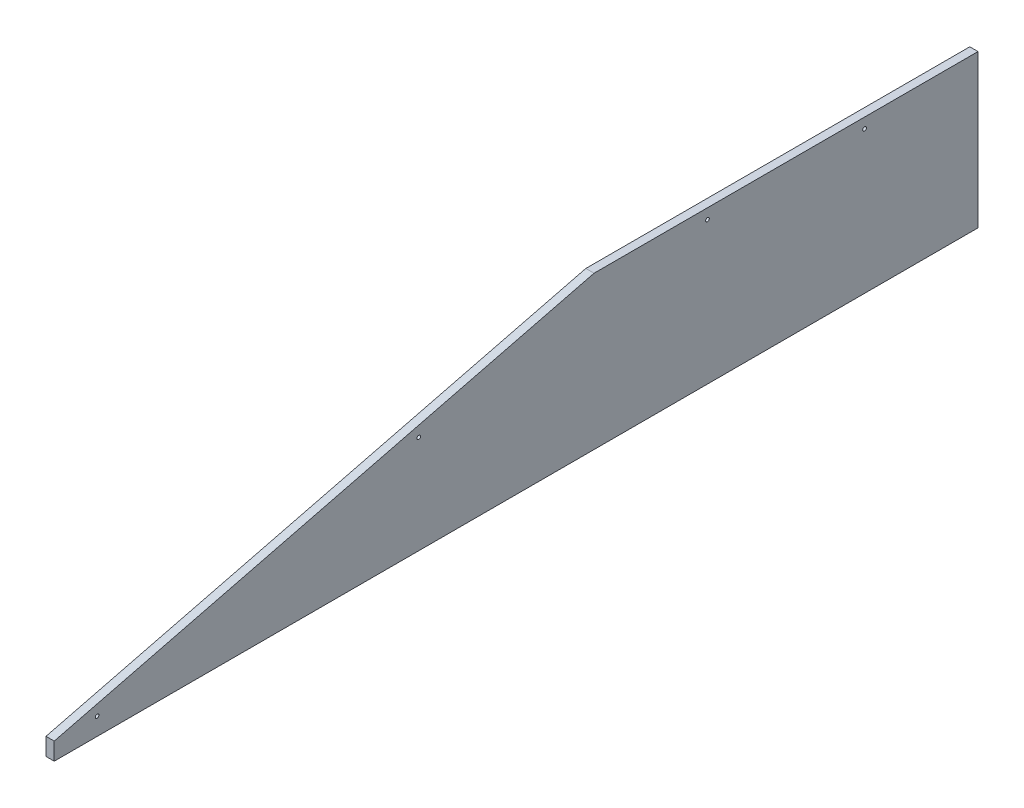
ISO-10303-21;
HEADER;
FILE_DESCRIPTION(('STEP AP214'),'2;1');
FILE_NAME('part.step','',(''),(''),'','','');
FILE_SCHEMA(('AUTOMOTIVE_DESIGN { 1 0 10303 214 1 1 1 1 }'));
ENDSEC;
DATA;
#1=APPLICATION_CONTEXT('core data for automotive mechanical design processes');
#2=APPLICATION_PROTOCOL_DEFINITION('international standard','automotive_design',2000,#1);
#3=PRODUCT_CONTEXT('',#1,'mechanical');
#4=PRODUCT('Part','Part','',(#3));
#5=PRODUCT_RELATED_PRODUCT_CATEGORY('part','',(#4));
#6=PRODUCT_DEFINITION_FORMATION('','',#4);
#7=PRODUCT_DEFINITION_CONTEXT('part definition',#1,'design');
#8=PRODUCT_DEFINITION('design','',#6,#7);
#9=PRODUCT_DEFINITION_SHAPE('','',#8);
#10=(LENGTH_UNIT() NAMED_UNIT(*) SI_UNIT(.MILLI.,.METRE.));
#11=(NAMED_UNIT(*) PLANE_ANGLE_UNIT() SI_UNIT($,.RADIAN.));
#12=(NAMED_UNIT(*) SI_UNIT($,.STERADIAN.) SOLID_ANGLE_UNIT());
#13=UNCERTAINTY_MEASURE_WITH_UNIT(LENGTH_MEASURE(1.E-05),#10,'distance_accuracy_value','');
#14=(GEOMETRIC_REPRESENTATION_CONTEXT(3) GLOBAL_UNCERTAINTY_ASSIGNED_CONTEXT((#13)) GLOBAL_UNIT_ASSIGNED_CONTEXT((#10,
#11,#12)) REPRESENTATION_CONTEXT('',''));
#15=CARTESIAN_POINT('',(0.,0.,0.));
#16=DIRECTION('',(0.,0.,1.));
#17=DIRECTION('',(1.,0.,0.));
#18=AXIS2_PLACEMENT_3D('',#15,#16,#17);
#19=CARTESIAN_POINT('',(0.,222.25,0.));
#20=DIRECTION('',(0.,1.,0.));
#21=DIRECTION('',(0.,0.,1.));
#22=AXIS2_PLACEMENT_3D('',#19,#20,#21);
#23=PLANE('',#22);
#24=DIRECTION('',(-1.,0.,0.));
#25=VECTOR('',#24,1.);
#26=CARTESIAN_POINT('',(6.,222.25,558.8));
#27=LINE('',#26,#25);
#28=CARTESIAN_POINT('',(12.,222.25,558.799999855873));
#29=VERTEX_POINT('',#28);
#30=CARTESIAN_POINT('',(0.,222.25,558.8));
#31=VERTEX_POINT('',#30);
#32=EDGE_CURVE('E81',#29,#31,#27,.T.);
#33=ORIENTED_EDGE('',*,*,#32,.F.);
#34=DIRECTION('',(0.,0.,1.));
#35=VECTOR('',#34,1.);
#36=CARTESIAN_POINT('',(12.,222.25,672.2051232825));
#37=LINE('',#36,#35);
#38=CARTESIAN_POINT('',(12.,222.25,0.));
#39=VERTEX_POINT('',#38);
#40=EDGE_CURVE('E63',#39,#29,#37,.T.);
#41=ORIENTED_EDGE('',*,*,#40,.F.);
#42=DIRECTION('',(1.,0.,0.));
#43=VECTOR('',#42,1.);
#44=CARTESIAN_POINT('',(6.,222.25,0.));
#45=LINE('',#44,#43);
#46=CARTESIAN_POINT('',(0.,222.25,0.));
#47=VERTEX_POINT('',#46);
#48=EDGE_CURVE('E123',#47,#39,#45,.T.);
#49=ORIENTED_EDGE('',*,*,#48,.F.);
#50=DIRECTION('',(0.,0.,1.));
#51=VECTOR('',#50,1.);
#52=CARTESIAN_POINT('',(0.,222.25,672.2051232825));
#53=LINE('',#52,#51);
#54=EDGE_CURVE('E91',#47,#31,#53,.T.);
#55=ORIENTED_EDGE('',*,*,#54,.T.);
#56=EDGE_LOOP('',(#33,#41,#49,#55));
#57=FACE_BOUND('',#56,.T.);
#58=ADVANCED_FACE('F16',(#57),#23,.T.);
#59=CARTESIAN_POINT('',(0.,222.25,558.8));
#60=DIRECTION('',(0.,0.970012369464204,0.243055555555601));
#61=DIRECTION('',(0.,-0.243055555555601,0.970012369464204));
#62=AXIS2_PLACEMENT_3D('',#59,#60,#61);
#63=PLANE('',#62);
#64=DIRECTION('',(1.,0.,0.));
#65=VECTOR('',#64,1.);
#66=CARTESIAN_POINT('',(6.,25.4,1344.410246565));
#67=LINE('',#66,#65);
#68=CARTESIAN_POINT('',(0.,25.4,1344.410246565));
#69=VERTEX_POINT('',#68);
#70=CARTESIAN_POINT('',(12.,25.39999996825,1344.410246565));
#71=VERTEX_POINT('',#70);
#72=EDGE_CURVE('E73',#69,#71,#67,.T.);
#73=ORIENTED_EDGE('',*,*,#72,.T.);
#74=DIRECTION('',(0.,-0.243055555545461,0.970012369466744));
#75=VECTOR('',#74,1.);
#76=CARTESIAN_POINT('',(12.,222.24999994903,558.799999915165));
#77=LINE('',#76,#75);
#78=EDGE_CURVE('E20',#29,#71,#77,.T.);
#79=ORIENTED_EDGE('',*,*,#78,.F.);
#80=ORIENTED_EDGE('',*,*,#32,.T.);
#81=DIRECTION('',(0.,-0.243055555555601,0.970012369464204));
#82=VECTOR('',#81,1.);
#83=CARTESIAN_POINT('',(0.,222.25,558.8));
#84=LINE('',#83,#82);
#85=EDGE_CURVE('E76',#31,#69,#84,.T.);
#86=ORIENTED_EDGE('',*,*,#85,.T.);
#87=EDGE_LOOP('',(#73,#79,#80,#86));
#88=FACE_BOUND('',#87,.T.);
#89=ADVANCED_FACE('F74',(#88),#63,.T.);
#90=CARTESIAN_POINT('',(12.,0.,1344.410246565));
#91=DIRECTION('',(0.,0.,-1.));
#92=DIRECTION('',(-1.,0.,0.));
#93=AXIS2_PLACEMENT_3D('',#90,#91,#92);
#94=PLANE('',#93);
#95=ORIENTED_EDGE('',*,*,#72,.F.);
#96=DIRECTION('',(0.,-1.,0.));
#97=VECTOR('',#96,1.);
#98=CARTESIAN_POINT('',(0.,111.125,1344.410246565));
#99=LINE('',#98,#97);
#100=CARTESIAN_POINT('',(0.,0.,1344.410246565));
#101=VERTEX_POINT('',#100);
#102=EDGE_CURVE('E95',#69,#101,#99,.T.);
#103=ORIENTED_EDGE('',*,*,#102,.T.);
#104=DIRECTION('',(-1.,0.,0.));
#105=VECTOR('',#104,1.);
#106=CARTESIAN_POINT('',(6.,0.,1344.410246565));
#107=LINE('',#106,#105);
#108=CARTESIAN_POINT('',(12.,0.,1344.410246565));
#109=VERTEX_POINT('',#108);
#110=EDGE_CURVE('E80',#109,#101,#107,.T.);
#111=ORIENTED_EDGE('',*,*,#110,.F.);
#112=DIRECTION('',(0.,-1.,0.));
#113=VECTOR('',#112,1.);
#114=CARTESIAN_POINT('',(12.,111.125,1344.410246565));
#115=LINE('',#114,#113);
#116=EDGE_CURVE('E69',#71,#109,#115,.T.);
#117=ORIENTED_EDGE('',*,*,#116,.F.);
#118=EDGE_LOOP('',(#95,#103,#111,#117));
#119=FACE_BOUND('',#118,.T.);
#120=ADVANCED_FACE('F83',(#119),#94,.F.);
#121=CARTESIAN_POINT('',(0.,0.,1344.410246565));
#122=DIRECTION('',(0.,-1.,0.));
#123=DIRECTION('',(0.,0.,-1.));
#124=AXIS2_PLACEMENT_3D('',#121,#122,#123);
#125=PLANE('',#124);
#126=DIRECTION('',(-1.,0.,0.));
#127=VECTOR('',#126,1.);
#128=CARTESIAN_POINT('',(6.,0.,0.));
#129=LINE('',#128,#127);
#130=CARTESIAN_POINT('',(12.,0.,0.));
#131=VERTEX_POINT('',#130);
#132=CARTESIAN_POINT('',(0.,0.,0.));
#133=VERTEX_POINT('',#132);
#134=EDGE_CURVE('E35',#131,#133,#129,.T.);
#135=ORIENTED_EDGE('',*,*,#134,.F.);
#136=DIRECTION('',(0.,0.,-1.));
#137=VECTOR('',#136,1.);
#138=CARTESIAN_POINT('',(12.,0.,672.2051232825));
#139=LINE('',#138,#137);
#140=EDGE_CURVE('E85',#109,#131,#139,.T.);
#141=ORIENTED_EDGE('',*,*,#140,.F.);
#142=ORIENTED_EDGE('',*,*,#110,.T.);
#143=DIRECTION('',(0.,0.,-1.));
#144=VECTOR('',#143,1.);
#145=CARTESIAN_POINT('',(0.,0.,672.2051232825));
#146=LINE('',#145,#144);
#147=EDGE_CURVE('E96',#101,#133,#146,.T.);
#148=ORIENTED_EDGE('',*,*,#147,.T.);
#149=EDGE_LOOP('',(#135,#141,#142,#148));
#150=FACE_BOUND('',#149,.T.);
#151=ADVANCED_FACE('F134',(#150),#125,.T.);
#152=CARTESIAN_POINT('',(0.,0.,0.));
#153=DIRECTION('',(0.,0.,-1.));
#154=DIRECTION('',(0.,1.,0.));
#155=AXIS2_PLACEMENT_3D('',#152,#153,#154);
#156=PLANE('',#155);
#157=ORIENTED_EDGE('',*,*,#48,.T.);
#158=DIRECTION('',(0.,1.,0.));
#159=VECTOR('',#158,1.);
#160=CARTESIAN_POINT('',(12.,111.125,0.));
#161=LINE('',#160,#159);
#162=EDGE_CURVE('E87',#131,#39,#161,.T.);
#163=ORIENTED_EDGE('',*,*,#162,.F.);
#164=ORIENTED_EDGE('',*,*,#134,.T.);
#165=DIRECTION('',(0.,1.,0.));
#166=VECTOR('',#165,1.);
#167=CARTESIAN_POINT('',(0.,111.125,0.));
#168=LINE('',#167,#166);
#169=EDGE_CURVE('E109',#133,#47,#168,.T.);
#170=ORIENTED_EDGE('',*,*,#169,.T.);
#171=EDGE_LOOP('',(#157,#163,#164,#170));
#172=FACE_BOUND('',#171,.T.);
#173=ADVANCED_FACE('F131',(#172),#156,.T.);
#174=CARTESIAN_POINT('',(12.,142.890477965,813.859868381));
#175=DIRECTION('',(-1.,0.,0.));
#176=DIRECTION('',(0.,0.,1.));
#177=AXIS2_PLACEMENT_3D('',#174,#175,#176);
#178=CYLINDRICAL_SURFACE('',#177,2.66699999999997);
#179=CARTESIAN_POINT('',(0.,142.890477965,813.859868381));
#180=DIRECTION('',(-1.,0.,0.));
#181=DIRECTION('',(0.,0.,1.));
#182=AXIS2_PLACEMENT_3D('',#179,#180,#181);
#183=CIRCLE('',#182,2.66699999999997);
#184=CARTESIAN_POINT('',(0.,142.890477965,816.526868381));
#185=VERTEX_POINT('',#184);
#186=EDGE_CURVE('E106',#185,#185,#183,.T.);
#187=ORIENTED_EDGE('',*,*,#186,.T.);
#188=EDGE_LOOP('',(#187));
#189=FACE_BOUND('',#188,.T.);
#190=CARTESIAN_POINT('',(12.,142.890477965,813.859868381));
#191=DIRECTION('',(-1.,0.,0.));
#192=DIRECTION('',(0.,0.,1.));
#193=AXIS2_PLACEMENT_3D('',#190,#191,#192);
#194=CIRCLE('',#193,2.66699999999997);
#195=CARTESIAN_POINT('',(12.,142.890477965,816.526868381));
#196=VERTEX_POINT('',#195);
#197=EDGE_CURVE('E115',#196,#196,#194,.T.);
#198=ORIENTED_EDGE('',*,*,#197,.F.);
#199=EDGE_LOOP('',(#198));
#200=FACE_BOUND('',#199,.T.);
#201=ADVANCED_FACE('F142',(#189,#200),#178,.F.);
#202=CARTESIAN_POINT('',(12.,207.264,393.7));
#203=DIRECTION('',(-1.,0.,0.));
#204=DIRECTION('',(0.,0.,1.));
#205=AXIS2_PLACEMENT_3D('',#202,#203,#204);
#206=CYLINDRICAL_SURFACE('',#205,2.66700000000003);
#207=CARTESIAN_POINT('',(0.,207.264,393.7));
#208=DIRECTION('',(-1.,0.,0.));
#209=DIRECTION('',(0.,0.,1.));
#210=AXIS2_PLACEMENT_3D('',#207,#208,#209);
#211=CIRCLE('',#210,2.66700000000003);
#212=CARTESIAN_POINT('',(0.,207.264,396.367));
#213=VERTEX_POINT('',#212);
#214=EDGE_CURVE('E103',#213,#213,#211,.T.);
#215=ORIENTED_EDGE('',*,*,#214,.T.);
#216=EDGE_LOOP('',(#215));
#217=FACE_BOUND('',#216,.T.);
#218=CARTESIAN_POINT('',(12.,207.264,393.7));
#219=DIRECTION('',(-1.,0.,0.));
#220=DIRECTION('',(0.,0.,1.));
#221=AXIS2_PLACEMENT_3D('',#218,#219,#220);
#222=CIRCLE('',#221,2.66700000000003);
#223=CARTESIAN_POINT('',(12.,207.264,396.367));
#224=VERTEX_POINT('',#223);
#225=EDGE_CURVE('E113',#224,#224,#222,.T.);
#226=ORIENTED_EDGE('',*,*,#225,.F.);
#227=EDGE_LOOP('',(#226));
#228=FACE_BOUND('',#227,.T.);
#229=ADVANCED_FACE('F158',(#217,#228),#206,.F.);
#230=CARTESIAN_POINT('',(12.,207.264,165.1));
#231=DIRECTION('',(-1.,0.,0.));
#232=DIRECTION('',(0.,0.,1.));
#233=AXIS2_PLACEMENT_3D('',#230,#231,#232);
#234=CYLINDRICAL_SURFACE('',#233,2.667);
#235=CARTESIAN_POINT('',(0.,207.264,165.1));
#236=DIRECTION('',(-1.,0.,0.));
#237=DIRECTION('',(0.,0.,1.));
#238=AXIS2_PLACEMENT_3D('',#235,#236,#237);
#239=CIRCLE('',#238,2.667);
#240=CARTESIAN_POINT('',(0.,207.264,167.767));
#241=VERTEX_POINT('',#240);
#242=EDGE_CURVE('E100',#241,#241,#239,.T.);
#243=ORIENTED_EDGE('',*,*,#242,.T.);
#244=EDGE_LOOP('',(#243));
#245=FACE_BOUND('',#244,.T.);
#246=CARTESIAN_POINT('',(12.,207.264,165.1));
#247=DIRECTION('',(-1.,0.,0.));
#248=DIRECTION('',(0.,0.,1.));
#249=AXIS2_PLACEMENT_3D('',#246,#247,#248);
#250=CIRCLE('',#249,2.667);
#251=CARTESIAN_POINT('',(12.,207.264,167.767));
#252=VERTEX_POINT('',#251);
#253=EDGE_CURVE('E94',#252,#252,#250,.T.);
#254=ORIENTED_EDGE('',*,*,#253,.F.);
#255=EDGE_LOOP('',(#254));
#256=FACE_BOUND('',#255,.T.);
#257=ADVANCED_FACE('F155',(#245,#256),#234,.F.);
#258=CARTESIAN_POINT('',(12.,0.,1344.410246565));
#259=DIRECTION('',(1.,0.,0.));
#260=DIRECTION('',(0.,0.,-1.));
#261=AXIS2_PLACEMENT_3D('',#258,#259,#260);
#262=PLANE('',#261);
#263=ORIENTED_EDGE('',*,*,#253,.T.);
#264=EDGE_LOOP('',(#263));
#265=FACE_BOUND('',#264,.T.);
#266=ORIENTED_EDGE('',*,*,#225,.T.);
#267=EDGE_LOOP('',(#266));
#268=FACE_BOUND('',#267,.T.);
#269=ORIENTED_EDGE('',*,*,#197,.T.);
#270=EDGE_LOOP('',(#269));
#271=FACE_BOUND('',#270,.T.);
#272=CARTESIAN_POINT('',(12.,25.591866853,1281.987837884));
#273=DIRECTION('',(-1.,0.,0.));
#274=DIRECTION('',(0.,0.,1.));
#275=AXIS2_PLACEMENT_3D('',#272,#273,#274);
#276=CIRCLE('',#275,2.66699999999975);
#277=CARTESIAN_POINT('',(12.,25.591866853,1284.654837884));
#278=VERTEX_POINT('',#277);
#279=EDGE_CURVE('E26',#278,#278,#276,.F.);
#280=ORIENTED_EDGE('',*,*,#279,.F.);
#281=EDGE_LOOP('',(#280));
#282=FACE_BOUND('',#281,.T.);
#283=ORIENTED_EDGE('',*,*,#140,.T.);
#284=ORIENTED_EDGE('',*,*,#162,.T.);
#285=ORIENTED_EDGE('',*,*,#40,.T.);
#286=ORIENTED_EDGE('',*,*,#78,.T.);
#287=ORIENTED_EDGE('',*,*,#116,.T.);
#288=EDGE_LOOP('',(#283,#284,#285,#286,#287));
#289=FACE_BOUND('',#288,.T.);
#290=ADVANCED_FACE('F67',(#265,#268,#271,#282,#289),#262,.T.);
#291=CARTESIAN_POINT('',(0.,0.,1344.410246565));
#292=DIRECTION('',(1.,0.,0.));
#293=DIRECTION('',(0.,0.,-1.));
#294=AXIS2_PLACEMENT_3D('',#291,#292,#293);
#295=PLANE('',#294);
#296=ORIENTED_EDGE('',*,*,#242,.F.);
#297=EDGE_LOOP('',(#296));
#298=FACE_BOUND('',#297,.T.);
#299=ORIENTED_EDGE('',*,*,#214,.F.);
#300=EDGE_LOOP('',(#299));
#301=FACE_BOUND('',#300,.T.);
#302=ORIENTED_EDGE('',*,*,#186,.F.);
#303=EDGE_LOOP('',(#302));
#304=FACE_BOUND('',#303,.T.);
#305=CARTESIAN_POINT('',(0.,25.591866853,1281.987837884));
#306=DIRECTION('',(-1.,0.,0.));
#307=DIRECTION('',(0.,0.,1.));
#308=AXIS2_PLACEMENT_3D('',#305,#306,#307);
#309=CIRCLE('',#308,2.66699999999975);
#310=CARTESIAN_POINT('',(0.,25.591866853,1284.654837884));
#311=VERTEX_POINT('',#310);
#312=EDGE_CURVE('E10',#311,#311,#309,.T.);
#313=ORIENTED_EDGE('',*,*,#312,.F.);
#314=EDGE_LOOP('',(#313));
#315=FACE_BOUND('',#314,.T.);
#316=ORIENTED_EDGE('',*,*,#147,.F.);
#317=ORIENTED_EDGE('',*,*,#102,.F.);
#318=ORIENTED_EDGE('',*,*,#85,.F.);
#319=ORIENTED_EDGE('',*,*,#54,.F.);
#320=ORIENTED_EDGE('',*,*,#169,.F.);
#321=EDGE_LOOP('',(#316,#317,#318,#319,#320));
#322=FACE_BOUND('',#321,.T.);
#323=ADVANCED_FACE('F18',(#298,#301,#304,#315,#322),#295,.F.);
#324=CARTESIAN_POINT('',(12.,25.591866853,1281.987837884));
#325=DIRECTION('',(-1.,0.,0.));
#326=DIRECTION('',(0.,0.,1.));
#327=AXIS2_PLACEMENT_3D('',#324,#325,#326);
#328=CYLINDRICAL_SURFACE('',#327,2.66699999999975);
#329=ORIENTED_EDGE('',*,*,#312,.T.);
#330=EDGE_LOOP('',(#329));
#331=FACE_BOUND('',#330,.T.);
#332=ORIENTED_EDGE('',*,*,#279,.T.);
#333=EDGE_LOOP('',(#332));
#334=FACE_BOUND('',#333,.T.);
#335=ADVANCED_FACE('F145',(#331,#334),#328,.F.);
#336=CLOSED_SHELL('',(#58,#89,#120,#151,#173,#201,#229,#257,#290,#323,#335));
#337=MANIFOLD_SOLID_BREP('B1',#336);
#338=ADVANCED_BREP_SHAPE_REPRESENTATION('',(#18,#337),#14);
#339=SHAPE_DEFINITION_REPRESENTATION(#9,#338);
ENDSEC;
END-ISO-10303-21;
